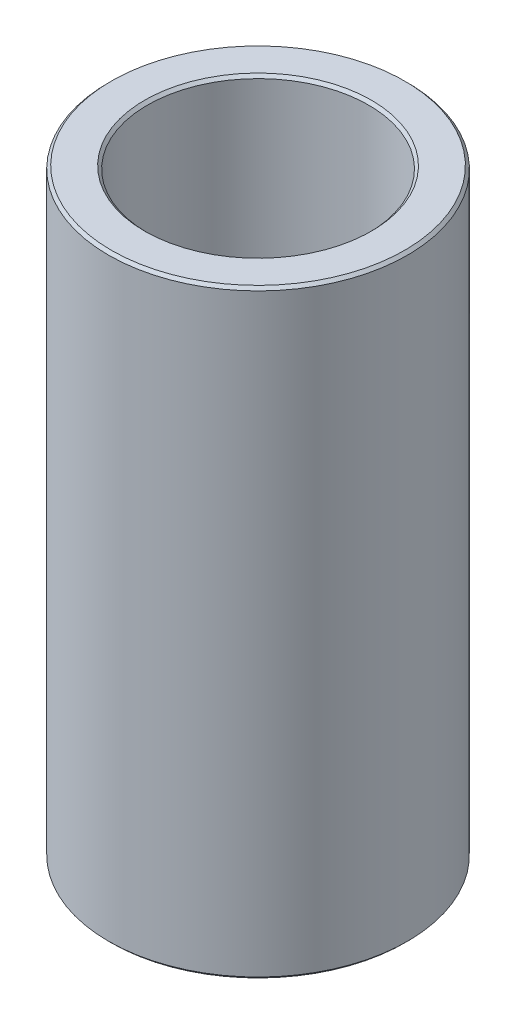
ISO-10303-21;
HEADER;
FILE_DESCRIPTION(('STEP AP214'),'2;1');
FILE_NAME('part.step','',(''),(''),'','','');
FILE_SCHEMA(('AUTOMOTIVE_DESIGN { 1 0 10303 214 1 1 1 1 }'));
ENDSEC;
DATA;
#1=APPLICATION_CONTEXT('core data for automotive mechanical design processes');
#2=APPLICATION_PROTOCOL_DEFINITION('international standard','automotive_design',2000,#1);
#3=PRODUCT_CONTEXT('',#1,'mechanical');
#4=PRODUCT('Part','Part','',(#3));
#5=PRODUCT_RELATED_PRODUCT_CATEGORY('part','',(#4));
#6=PRODUCT_DEFINITION_FORMATION('','',#4);
#7=PRODUCT_DEFINITION_CONTEXT('part definition',#1,'design');
#8=PRODUCT_DEFINITION('design','',#6,#7);
#9=PRODUCT_DEFINITION_SHAPE('','',#8);
#10=(LENGTH_UNIT() NAMED_UNIT(*) SI_UNIT(.MILLI.,.METRE.));
#11=(NAMED_UNIT(*) PLANE_ANGLE_UNIT() SI_UNIT($,.RADIAN.));
#12=(NAMED_UNIT(*) SI_UNIT($,.STERADIAN.) SOLID_ANGLE_UNIT());
#13=UNCERTAINTY_MEASURE_WITH_UNIT(LENGTH_MEASURE(1.E-05),#10,'distance_accuracy_value','');
#14=(GEOMETRIC_REPRESENTATION_CONTEXT(3) GLOBAL_UNCERTAINTY_ASSIGNED_CONTEXT((#13)) GLOBAL_UNIT_ASSIGNED_CONTEXT((#10,
#11,#12)) REPRESENTATION_CONTEXT('',''));
#15=CARTESIAN_POINT('',(0.,0.,0.));
#16=DIRECTION('',(0.,0.,1.));
#17=DIRECTION('',(1.,0.,0.));
#18=AXIS2_PLACEMENT_3D('',#15,#16,#17);
#19=CARTESIAN_POINT('',(0.,190.638783322495,0.));
#20=DIRECTION('',(0.,-1.,0.));
#21=DIRECTION('',(0.,0.,-1.));
#22=AXIS2_PLACEMENT_3D('',#19,#20,#21);
#23=CYLINDRICAL_SURFACE('',#22,47.5);
#24=CARTESIAN_POINT('',(0.,0.894963014745176,0.));
#25=DIRECTION('',(0.,1.,0.));
#26=DIRECTION('',(0.,0.,1.));
#27=AXIS2_PLACEMENT_3D('',#24,#25,#26);
#28=CIRCLE('',#27,47.5);
#29=CARTESIAN_POINT('',(0.,0.894963014745176,47.5));
#30=VERTEX_POINT('',#29);
#31=EDGE_CURVE('E10',#30,#30,#28,.T.);
#32=ORIENTED_EDGE('',*,*,#31,.T.);
#33=EDGE_LOOP('',(#32));
#34=FACE_BOUND('',#33,.T.);
#35=CARTESIAN_POINT('',(0.,189.74382030775,0.));
#36=DIRECTION('',(0.,1.,0.));
#37=DIRECTION('',(0.,0.,1.));
#38=AXIS2_PLACEMENT_3D('',#35,#36,#37);
#39=CIRCLE('',#38,47.5);
#40=CARTESIAN_POINT('',(0.,189.74382030775,47.5));
#41=VERTEX_POINT('',#40);
#42=EDGE_CURVE('E50',#41,#41,#39,.F.);
#43=ORIENTED_EDGE('',*,*,#42,.T.);
#44=EDGE_LOOP('',(#43));
#45=FACE_BOUND('',#44,.T.);
#46=ADVANCED_FACE('F39',(#34,#45),#23,.T.);
#47=CARTESIAN_POINT('',(0.,190.638783322495,0.));
#48=DIRECTION('',(0.,1.,0.));
#49=DIRECTION('',(0.,0.,1.));
#50=AXIS2_PLACEMENT_3D('',#47,#48,#49);
#51=PLANE('',#50);
#52=CARTESIAN_POINT('',(0.,190.638783322495,0.));
#53=DIRECTION('',(0.,1.,0.));
#54=DIRECTION('',(0.,0.,1.));
#55=AXIS2_PLACEMENT_3D('',#52,#53,#54);
#56=CIRCLE('',#55,36.0561800217453);
#57=CARTESIAN_POINT('',(0.,190.638783322495,36.0561800217453));
#58=VERTEX_POINT('',#57);
#59=EDGE_CURVE('E58',#58,#58,#56,.F.);
#60=ORIENTED_EDGE('',*,*,#59,.T.);
#61=EDGE_LOOP('',(#60));
#62=FACE_BOUND('',#61,.T.);
#63=CARTESIAN_POINT('',(0.,190.638783322495,0.));
#64=DIRECTION('',(0.,1.,0.));
#65=DIRECTION('',(0.,0.,1.));
#66=AXIS2_PLACEMENT_3D('',#63,#64,#65);
#67=CIRCLE('',#66,46.6050369852548);
#68=CARTESIAN_POINT('',(0.,190.638783322495,46.6050369852548));
#69=VERTEX_POINT('',#68);
#70=EDGE_CURVE('E61',#69,#69,#67,.T.);
#71=ORIENTED_EDGE('',*,*,#70,.T.);
#72=EDGE_LOOP('',(#71));
#73=FACE_BOUND('',#72,.T.);
#74=ADVANCED_FACE('F88',(#62,#73),#51,.T.);
#75=CARTESIAN_POINT('',(0.,0.,0.));
#76=DIRECTION('',(0.,1.,0.));
#77=DIRECTION('',(0.,0.,1.));
#78=AXIS2_PLACEMENT_3D('',#75,#76,#77);
#79=PLANE('',#78);
#80=CARTESIAN_POINT('',(0.,0.,0.));
#81=DIRECTION('',(0.,1.,0.));
#82=DIRECTION('',(0.,0.,1.));
#83=AXIS2_PLACEMENT_3D('',#80,#81,#82);
#84=CIRCLE('',#83,36.0561800217453);
#85=CARTESIAN_POINT('',(0.,0.,36.0561800217453));
#86=VERTEX_POINT('',#85);
#87=EDGE_CURVE('E51',#86,#86,#84,.T.);
#88=ORIENTED_EDGE('',*,*,#87,.T.);
#89=EDGE_LOOP('',(#88));
#90=FACE_BOUND('',#89,.T.);
#91=CARTESIAN_POINT('',(0.,0.,0.));
#92=DIRECTION('',(0.,1.,0.));
#93=DIRECTION('',(0.,0.,1.));
#94=AXIS2_PLACEMENT_3D('',#91,#92,#93);
#95=CIRCLE('',#94,46.6050369852548);
#96=CARTESIAN_POINT('',(0.,0.,46.6050369852548));
#97=VERTEX_POINT('',#96);
#98=EDGE_CURVE('E54',#97,#97,#95,.F.);
#99=ORIENTED_EDGE('',*,*,#98,.T.);
#100=EDGE_LOOP('',(#99));
#101=FACE_BOUND('',#100,.T.);
#102=ADVANCED_FACE('F83',(#90,#101),#79,.F.);
#103=CARTESIAN_POINT('',(0.,190.638783322495,0.));
#104=DIRECTION('',(0.,-1.,0.));
#105=DIRECTION('',(0.,0.,-1.));
#106=AXIS2_PLACEMENT_3D('',#103,#104,#105);
#107=CYLINDRICAL_SURFACE('',#106,35.1612170070002);
#108=CARTESIAN_POINT('',(0.,189.74382030775,0.));
#109=DIRECTION('',(0.,1.,0.));
#110=DIRECTION('',(0.,0.,1.));
#111=AXIS2_PLACEMENT_3D('',#108,#109,#110);
#112=CIRCLE('',#111,35.1612170070002);
#113=CARTESIAN_POINT('',(0.,189.74382030775,35.1612170070002));
#114=VERTEX_POINT('',#113);
#115=EDGE_CURVE('E67',#114,#114,#112,.T.);
#116=ORIENTED_EDGE('',*,*,#115,.T.);
#117=EDGE_LOOP('',(#116));
#118=FACE_BOUND('',#117,.T.);
#119=CARTESIAN_POINT('',(0.,0.894963014745176,0.));
#120=DIRECTION('',(0.,1.,0.));
#121=DIRECTION('',(0.,0.,1.));
#122=AXIS2_PLACEMENT_3D('',#119,#120,#121);
#123=CIRCLE('',#122,35.1612170070002);
#124=CARTESIAN_POINT('',(0.,0.894963014745176,35.1612170070002));
#125=VERTEX_POINT('',#124);
#126=EDGE_CURVE('E69',#125,#125,#123,.F.);
#127=ORIENTED_EDGE('',*,*,#126,.T.);
#128=EDGE_LOOP('',(#127));
#129=FACE_BOUND('',#128,.T.);
#130=ADVANCED_FACE('F71',(#118,#129),#107,.F.);
#131=CARTESIAN_POINT('',(0.,189.74382030775,0.));
#132=DIRECTION('',(0.,1.,0.));
#133=DIRECTION('',(0.,0.,1.));
#134=AXIS2_PLACEMENT_3D('',#131,#132,#133);
#135=CONICAL_SURFACE('',#134,35.1612170070002,0.785398163397456);
#136=ORIENTED_EDGE('',*,*,#59,.F.);
#137=EDGE_LOOP('',(#136));
#138=FACE_BOUND('',#137,.T.);
#139=ORIENTED_EDGE('',*,*,#115,.F.);
#140=EDGE_LOOP('',(#139));
#141=FACE_BOUND('',#140,.T.);
#142=ADVANCED_FACE('F77',(#138,#141),#135,.F.);
#143=CARTESIAN_POINT('',(0.,0.,0.));
#144=DIRECTION('',(0.,-1.,0.));
#145=DIRECTION('',(0.,0.,-1.));
#146=AXIS2_PLACEMENT_3D('',#143,#144,#145);
#147=CONICAL_SURFACE('',#146,36.0561800217453,0.785398163397456);
#148=ORIENTED_EDGE('',*,*,#126,.F.);
#149=EDGE_LOOP('',(#148));
#150=FACE_BOUND('',#149,.T.);
#151=ORIENTED_EDGE('',*,*,#87,.F.);
#152=EDGE_LOOP('',(#151));
#153=FACE_BOUND('',#152,.T.);
#154=ADVANCED_FACE('F73',(#150,#153),#147,.F.);
#155=CARTESIAN_POINT('',(0.,0.894963014745176,0.));
#156=DIRECTION('',(0.,1.,0.));
#157=DIRECTION('',(0.,0.,1.));
#158=AXIS2_PLACEMENT_3D('',#155,#156,#157);
#159=CONICAL_SURFACE('',#158,47.5,0.785398163397445);
#160=ORIENTED_EDGE('',*,*,#98,.F.);
#161=EDGE_LOOP('',(#160));
#162=FACE_BOUND('',#161,.T.);
#163=ORIENTED_EDGE('',*,*,#31,.F.);
#164=EDGE_LOOP('',(#163));
#165=FACE_BOUND('',#164,.T.);
#166=ADVANCED_FACE('F76',(#162,#165),#159,.T.);
#167=CARTESIAN_POINT('',(0.,190.638783322495,0.));
#168=DIRECTION('',(0.,-1.,0.));
#169=DIRECTION('',(0.,0.,-1.));
#170=AXIS2_PLACEMENT_3D('',#167,#168,#169);
#171=CONICAL_SURFACE('',#170,46.6050369852548,0.785398163397448);
#172=ORIENTED_EDGE('',*,*,#42,.F.);
#173=EDGE_LOOP('',(#172));
#174=FACE_BOUND('',#173,.T.);
#175=ORIENTED_EDGE('',*,*,#70,.F.);
#176=EDGE_LOOP('',(#175));
#177=FACE_BOUND('',#176,.T.);
#178=ADVANCED_FACE('F45',(#174,#177),#171,.T.);
#179=CLOSED_SHELL('',(#46,#74,#102,#130,#142,#154,#166,#178));
#180=MANIFOLD_SOLID_BREP('B2',#179);
#181=ADVANCED_BREP_SHAPE_REPRESENTATION('',(#18,#180),#14);
#182=SHAPE_DEFINITION_REPRESENTATION(#9,#181);
ENDSEC;
END-ISO-10303-21;
